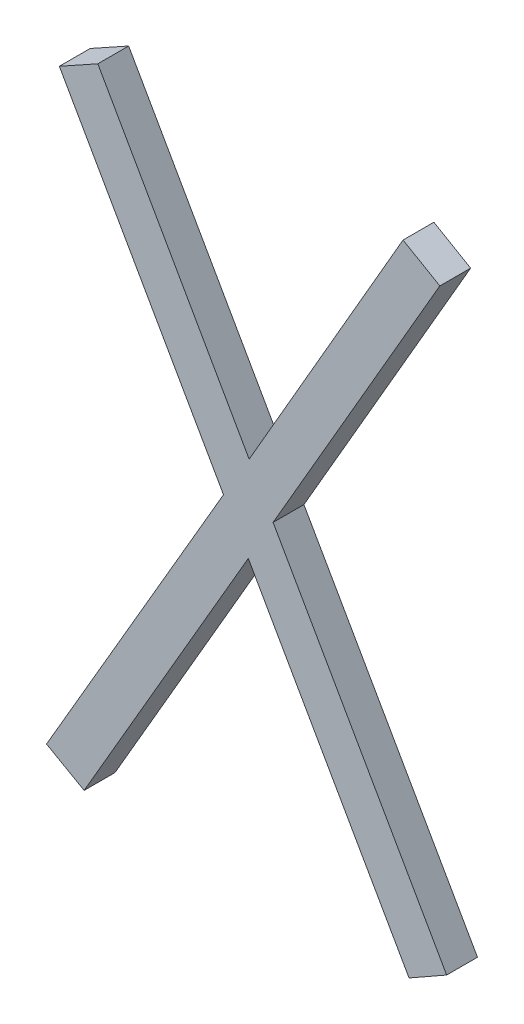
ISO-10303-21;
HEADER;
FILE_DESCRIPTION(('STEP AP214'),'2;1');
FILE_NAME('part.step','',(''),(''),'','','');
FILE_SCHEMA(('AUTOMOTIVE_DESIGN { 1 0 10303 214 1 1 1 1 }'));
ENDSEC;
DATA;
#1=APPLICATION_CONTEXT('core data for automotive mechanical design processes');
#2=APPLICATION_PROTOCOL_DEFINITION('international standard','automotive_design',2000,#1);
#3=PRODUCT_CONTEXT('',#1,'mechanical');
#4=PRODUCT('Part','Part','',(#3));
#5=PRODUCT_RELATED_PRODUCT_CATEGORY('part','',(#4));
#6=PRODUCT_DEFINITION_FORMATION('','',#4);
#7=PRODUCT_DEFINITION_CONTEXT('part definition',#1,'design');
#8=PRODUCT_DEFINITION('design','',#6,#7);
#9=PRODUCT_DEFINITION_SHAPE('','',#8);
#10=(LENGTH_UNIT() NAMED_UNIT(*) SI_UNIT(.MILLI.,.METRE.));
#11=(NAMED_UNIT(*) PLANE_ANGLE_UNIT() SI_UNIT($,.RADIAN.));
#12=(NAMED_UNIT(*) SI_UNIT($,.STERADIAN.) SOLID_ANGLE_UNIT());
#13=UNCERTAINTY_MEASURE_WITH_UNIT(LENGTH_MEASURE(1.E-05),#10,'distance_accuracy_value','');
#14=(GEOMETRIC_REPRESENTATION_CONTEXT(3) GLOBAL_UNCERTAINTY_ASSIGNED_CONTEXT((#13)) GLOBAL_UNIT_ASSIGNED_CONTEXT((#10,
#11,#12)) REPRESENTATION_CONTEXT('',''));
#15=CARTESIAN_POINT('',(0.,0.,0.));
#16=DIRECTION('',(0.,0.,1.));
#17=DIRECTION('',(1.,0.,0.));
#18=AXIS2_PLACEMENT_3D('',#15,#16,#17);
#19=CARTESIAN_POINT('',(69.1369278636028,62.3126359816895,-39.));
#20=DIRECTION('',(0.,0.,-1.));
#21=DIRECTION('',(-1.,0.,0.));
#22=AXIS2_PLACEMENT_3D('',#19,#20,#21);
#23=PLANE('',#22);
#24=DIRECTION('',(-0.501757199087616,-0.865008504677122,0.));
#25=VECTOR('',#24,1.);
#26=CARTESIAN_POINT('',(69.2544005786117,62.2458901208888,-39.));
#27=LINE('',#26,#25);
#28=CARTESIAN_POINT('',(69.2544005785957,62.245890120898,-39.));
#29=VERTEX_POINT('',#28);
#30=CARTESIAN_POINT('',(69.7869941985798,63.1640593303252,-39.));
#31=VERTEX_POINT('',#30);
#32=EDGE_CURVE('E161',#29,#31,#27,.F.);
#33=ORIENTED_EDGE('',*,*,#32,.T.);
#34=DIRECTION('',(-0.493874000371207,0.869533479376925,0.));
#35=VECTOR('',#34,1.);
#36=CARTESIAN_POINT('',(69.7869941985484,63.1640593303073,-39.));
#37=LINE('',#36,#35);
#38=CARTESIAN_POINT('',(70.3084921180918,62.2458901208985,-39.));
#39=VERTEX_POINT('',#38);
#40=EDGE_CURVE('E156',#31,#39,#37,.F.);
#41=ORIENTED_EDGE('',*,*,#40,.T.);
#42=DIRECTION('',(-0.869456557392789,-0.494009407609491,0.));
#43=VECTOR('',#42,1.);
#44=CARTESIAN_POINT('',(70.3084921180962,62.2458901208908,-39.));
#45=LINE('',#44,#43);
#46=CARTESIAN_POINT('',(70.4305448226939,62.3152382485031,-39.));
#47=VERTEX_POINT('',#46);
#48=EDGE_CURVE('E152',#39,#47,#45,.F.);
#49=ORIENTED_EDGE('',*,*,#48,.T.);
#50=DIRECTION('',(0.494302224488502,-0.869290118927921,0.));
#51=VECTOR('',#50,1.);
#52=CARTESIAN_POINT('',(70.4305448227046,62.3152382485093,-39.));
#53=LINE('',#52,#51);
#54=CARTESIAN_POINT('',(69.8674380265982,63.3055295106284,-39.));
#55=VERTEX_POINT('',#54);
#56=EDGE_CURVE('E148',#47,#55,#53,.F.);
#57=ORIENTED_EDGE('',*,*,#56,.T.);
#58=DIRECTION('',(-0.500833770570709,-0.865543490678502,0.));
#59=VECTOR('',#58,1.);
#60=CARTESIAN_POINT('',(69.8674380266044,63.305529510633,-39.));
#61=LINE('',#60,#59);
#62=CARTESIAN_POINT('',(70.4083534218833,64.2403422706789,-39.));
#63=VERTEX_POINT('',#62);
#64=EDGE_CURVE('E144',#55,#63,#61,.F.);
#65=ORIENTED_EDGE('',*,*,#64,.T.);
#66=DIRECTION('',(0.864507186684205,-0.50262045737451,0.));
#67=VECTOR('',#66,1.);
#68=CARTESIAN_POINT('',(70.4083534218832,64.240342270679,-39.));
#69=LINE('',#68,#67);
#70=CARTESIAN_POINT('',(70.2890746424062,64.3096903982819,-39.));
#71=VERTEX_POINT('',#70);
#72=EDGE_CURVE('E140',#63,#71,#69,.F.);
#73=ORIENTED_EDGE('',*,*,#72,.T.);
#74=DIRECTION('',(0.499722453489597,0.866185586048589,0.));
#75=VECTOR('',#74,1.);
#76=CARTESIAN_POINT('',(70.2890746424062,64.309690398282,-39.));
#77=LINE('',#76,#75);
#78=CARTESIAN_POINT('',(69.789768123692,63.4442257658421,-39.));
#79=VERTEX_POINT('',#78);
#80=EDGE_CURVE('E136',#71,#79,#77,.F.);
#81=ORIENTED_EDGE('',*,*,#80,.T.);
#82=DIRECTION('',(0.493434547487691,-0.869782931164792,0.));
#83=VECTOR('',#82,1.);
#84=CARTESIAN_POINT('',(69.7897681236972,63.444225765845,-39.));
#85=LINE('',#84,#83);
#86=CARTESIAN_POINT('',(69.2987833802891,64.3096903982932,-39.));
#87=VERTEX_POINT('',#86);
#88=EDGE_CURVE('E132',#79,#87,#85,.F.);
#89=ORIENTED_EDGE('',*,*,#88,.T.);
#90=DIRECTION('',(0.874157276121608,0.485642931178506,0.));
#91=VECTOR('',#90,1.);
#92=CARTESIAN_POINT('',(69.2987833802856,64.3096903982996,-39.));
#93=LINE('',#92,#91);
#94=CARTESIAN_POINT('',(69.1739567506111,64.2403422707027,-39.));
#95=VERTEX_POINT('',#94);
#96=EDGE_CURVE('E128',#87,#95,#93,.F.);
#97=ORIENTED_EDGE('',*,*,#96,.T.);
#98=DIRECTION('',(-0.493921009717616,0.869506777523632,0.));
#99=VECTOR('',#98,1.);
#100=CARTESIAN_POINT('',(69.173956750611,64.2403422707029,-39.));
#101=LINE('',#100,#99);
#102=CARTESIAN_POINT('',(69.7065503705775,63.3027555855385,-39.));
#103=VERTEX_POINT('',#102);
#104=EDGE_CURVE('E104',#95,#103,#101,.F.);
#105=ORIENTED_EDGE('',*,*,#104,.T.);
#106=DIRECTION('',(0.50266266285791,0.864482647233937,0.));
#107=VECTOR('',#106,1.);
#108=CARTESIAN_POINT('',(69.7065503705391,63.3027555855609,-39.));
#109=LINE('',#108,#107);
#110=CARTESIAN_POINT('',(69.1323478739962,62.3152382485115,-39.));
#111=VERTEX_POINT('',#110);
#112=EDGE_CURVE('E106',#103,#111,#109,.F.);
#113=ORIENTED_EDGE('',*,*,#112,.T.);
#114=DIRECTION('',(-0.86945655739271,0.49400940760963,0.));
#115=VECTOR('',#114,1.);
#116=CARTESIAN_POINT('',(69.1323478739962,62.3152382485115,-39.));
#117=LINE('',#116,#115);
#118=EDGE_CURVE('E20',#111,#29,#117,.F.);
#119=ORIENTED_EDGE('',*,*,#118,.T.);
#120=EDGE_LOOP('',(#33,#41,#49,#57,#65,#73,#81,#89,#97,#105,#113,#119));
#121=FACE_BOUND('',#120,.T.);
#122=ADVANCED_FACE('F17',(#121),#23,.F.);
#123=CARTESIAN_POINT('',(69.1323478739962,62.3152382485115,-39.));
#124=DIRECTION('',(0.49400940760963,0.86945655739271,0.));
#125=DIRECTION('',(-0.86945655739271,0.49400940760963,0.));
#126=AXIS2_PLACEMENT_3D('',#123,#124,#125);
#127=PLANE('',#126);
#128=DIRECTION('',(0.,0.,1.));
#129=VECTOR('',#128,1.);
#130=CARTESIAN_POINT('',(69.2544005786117,62.2458901208887,-39.));
#131=LINE('',#130,#129);
#132=CARTESIAN_POINT('',(69.2544005785957,62.245890120898,-39.1));
#133=VERTEX_POINT('',#132);
#134=EDGE_CURVE('E117',#133,#29,#131,.T.);
#135=ORIENTED_EDGE('',*,*,#134,.T.);
#136=ORIENTED_EDGE('',*,*,#118,.F.);
#137=DIRECTION('',(0.,0.,1.));
#138=VECTOR('',#137,1.);
#139=CARTESIAN_POINT('',(69.1323478739963,62.3152382485114,-39.));
#140=LINE('',#139,#138);
#141=CARTESIAN_POINT('',(69.1323478739962,62.3152382485115,-39.1));
#142=VERTEX_POINT('',#141);
#143=EDGE_CURVE('E112',#111,#142,#140,.F.);
#144=ORIENTED_EDGE('',*,*,#143,.T.);
#145=DIRECTION('',(-0.869456557392426,0.494009407610129,0.));
#146=VECTOR('',#145,1.);
#147=CARTESIAN_POINT('',(69.2544005785903,62.2458901209011,-39.1));
#148=LINE('',#147,#146);
#149=EDGE_CURVE('E164',#133,#142,#148,.T.);
#150=ORIENTED_EDGE('',*,*,#149,.F.);
#151=EDGE_LOOP('',(#135,#136,#144,#150));
#152=FACE_BOUND('',#151,.T.);
#153=ADVANCED_FACE('F114',(#152),#127,.F.);
#154=CARTESIAN_POINT('',(69.7065503705391,63.3027555855609,-39.));
#155=DIRECTION('',(0.864482647233937,-0.50266266285791,0.));
#156=DIRECTION('',(0.50266266285791,0.864482647233937,0.));
#157=AXIS2_PLACEMENT_3D('',#154,#155,#156);
#158=PLANE('',#157);
#159=ORIENTED_EDGE('',*,*,#143,.F.);
#160=ORIENTED_EDGE('',*,*,#112,.F.);
#161=DIRECTION('',(0.,0.,1.));
#162=VECTOR('',#161,1.);
#163=CARTESIAN_POINT('',(69.7065503705903,63.3027555855311,-39.));
#164=LINE('',#163,#162);
#165=CARTESIAN_POINT('',(69.7065503705647,63.302755585546,-39.1));
#166=VERTEX_POINT('',#165);
#167=EDGE_CURVE('E124',#103,#166,#164,.F.);
#168=ORIENTED_EDGE('',*,*,#167,.T.);
#169=DIRECTION('',(0.502662662902861,0.864482647207799,0.));
#170=VECTOR('',#169,1.);
#171=CARTESIAN_POINT('',(69.1323478739962,62.3152382485115,-39.1));
#172=LINE('',#171,#170);
#173=EDGE_CURVE('E121',#142,#166,#172,.T.);
#174=ORIENTED_EDGE('',*,*,#173,.F.);
#175=EDGE_LOOP('',(#159,#160,#168,#174));
#176=FACE_BOUND('',#175,.T.);
#177=ADVANCED_FACE('F119',(#176),#158,.F.);
#178=CARTESIAN_POINT('',(69.173956750611,64.2403422707029,-39.));
#179=DIRECTION('',(0.869506777523632,0.493921009717616,0.));
#180=DIRECTION('',(-0.493921009717616,0.869506777523632,0.));
#181=AXIS2_PLACEMENT_3D('',#178,#179,#180);
#182=PLANE('',#181);
#183=ORIENTED_EDGE('',*,*,#167,.F.);
#184=ORIENTED_EDGE('',*,*,#104,.F.);
#185=DIRECTION('',(0.,0.,1.));
#186=VECTOR('',#185,1.);
#187=CARTESIAN_POINT('',(69.1739567506111,64.2403422707027,-39.));
#188=LINE('',#187,#186);
#189=CARTESIAN_POINT('',(69.1739567506111,64.2403422707027,-39.1));
#190=VERTEX_POINT('',#189);
#191=EDGE_CURVE('E130',#95,#190,#188,.F.);
#192=ORIENTED_EDGE('',*,*,#191,.T.);
#193=DIRECTION('',(-0.493921009717636,0.86950677752362,0.));
#194=VECTOR('',#193,1.);
#195=CARTESIAN_POINT('',(69.7065503705903,63.3027555855311,-39.1));
#196=LINE('',#195,#194);
#197=EDGE_CURVE('E167',#166,#190,#196,.T.);
#198=ORIENTED_EDGE('',*,*,#197,.F.);
#199=EDGE_LOOP('',(#183,#184,#192,#198));
#200=FACE_BOUND('',#199,.T.);
#201=ADVANCED_FACE('F232',(#200),#182,.F.);
#202=CARTESIAN_POINT('',(69.2987833802856,64.3096903982996,-39.));
#203=DIRECTION('',(0.485642931178506,-0.874157276121608,0.));
#204=DIRECTION('',(0.874157276121608,0.485642931178506,0.));
#205=AXIS2_PLACEMENT_3D('',#202,#203,#204);
#206=PLANE('',#205);
#207=ORIENTED_EDGE('',*,*,#191,.F.);
#208=ORIENTED_EDGE('',*,*,#96,.F.);
#209=DIRECTION('',(0.,0.,1.));
#210=VECTOR('',#209,1.);
#211=CARTESIAN_POINT('',(69.2987833802903,64.3096903982911,-39.));
#212=LINE('',#211,#210);
#213=CARTESIAN_POINT('',(69.2987833802879,64.3096903982953,-39.1));
#214=VERTEX_POINT('',#213);
#215=EDGE_CURVE('E134',#87,#214,#212,.F.);
#216=ORIENTED_EDGE('',*,*,#215,.T.);
#217=DIRECTION('',(0.874157276154727,0.48564293111889,0.));
#218=VECTOR('',#217,1.);
#219=CARTESIAN_POINT('',(69.1739567506111,64.2403422707027,-39.1));
#220=LINE('',#219,#218);
#221=EDGE_CURVE('E170',#190,#214,#220,.T.);
#222=ORIENTED_EDGE('',*,*,#221,.F.);
#223=EDGE_LOOP('',(#207,#208,#216,#222));
#224=FACE_BOUND('',#223,.T.);
#225=ADVANCED_FACE('F230',(#224),#206,.F.);
#226=CARTESIAN_POINT('',(69.7897681236972,63.444225765845,-39.));
#227=DIRECTION('',(-0.869782931164792,-0.493434547487691,0.));
#228=DIRECTION('',(0.493434547487691,-0.869782931164792,0.));
#229=AXIS2_PLACEMENT_3D('',#226,#227,#228);
#230=PLANE('',#229);
#231=ORIENTED_EDGE('',*,*,#215,.F.);
#232=ORIENTED_EDGE('',*,*,#88,.F.);
#233=DIRECTION('',(0.,0.,1.));
#234=VECTOR('',#233,1.);
#235=CARTESIAN_POINT('',(69.7897681236903,63.4442257658411,-39.));
#236=LINE('',#235,#234);
#237=CARTESIAN_POINT('',(69.7897681236937,63.4442257658431,-39.1));
#238=VERTEX_POINT('',#237);
#239=EDGE_CURVE('E138',#79,#238,#236,.F.);
#240=ORIENTED_EDGE('',*,*,#239,.T.);
#241=DIRECTION('',(0.493434547480771,-0.869782931168718,0.));
#242=VECTOR('',#241,1.);
#243=CARTESIAN_POINT('',(69.2987833802903,64.3096903982911,-39.1));
#244=LINE('',#243,#242);
#245=EDGE_CURVE('E173',#214,#238,#244,.T.);
#246=ORIENTED_EDGE('',*,*,#245,.F.);
#247=EDGE_LOOP('',(#231,#232,#240,#246));
#248=FACE_BOUND('',#247,.T.);
#249=ADVANCED_FACE('F225',(#248),#230,.F.);
#250=CARTESIAN_POINT('',(70.2890746424062,64.309690398282,-39.));
#251=DIRECTION('',(0.866185586048589,-0.499722453489597,0.));
#252=DIRECTION('',(0.499722453489597,0.866185586048589,0.));
#253=AXIS2_PLACEMENT_3D('',#250,#251,#252);
#254=PLANE('',#253);
#255=ORIENTED_EDGE('',*,*,#239,.F.);
#256=ORIENTED_EDGE('',*,*,#80,.F.);
#257=DIRECTION('',(0.,0.,1.));
#258=VECTOR('',#257,1.);
#259=CARTESIAN_POINT('',(70.2890746424062,64.3096903982819,-39.));
#260=LINE('',#259,#258);
#261=CARTESIAN_POINT('',(70.2890746424062,64.3096903982819,-39.1));
#262=VERTEX_POINT('',#261);
#263=EDGE_CURVE('E142',#71,#262,#260,.F.);
#264=ORIENTED_EDGE('',*,*,#263,.T.);
#265=DIRECTION('',(0.499722453489612,0.866185586048581,0.));
#266=VECTOR('',#265,1.);
#267=CARTESIAN_POINT('',(69.7897681236903,63.4442257658411,-39.1));
#268=LINE('',#267,#266);
#269=EDGE_CURVE('E176',#238,#262,#268,.T.);
#270=ORIENTED_EDGE('',*,*,#269,.F.);
#271=EDGE_LOOP('',(#255,#256,#264,#270));
#272=FACE_BOUND('',#271,.T.);
#273=ADVANCED_FACE('F220',(#272),#254,.F.);
#274=CARTESIAN_POINT('',(70.4083534218832,64.240342270679,-39.));
#275=DIRECTION('',(-0.50262045737451,-0.864507186684205,0.));
#276=DIRECTION('',(0.864507186684205,-0.50262045737451,0.));
#277=AXIS2_PLACEMENT_3D('',#274,#275,#276);
#278=PLANE('',#277);
#279=ORIENTED_EDGE('',*,*,#263,.F.);
#280=ORIENTED_EDGE('',*,*,#72,.F.);
#281=DIRECTION('',(0.,0.,1.));
#282=VECTOR('',#281,1.);
#283=CARTESIAN_POINT('',(70.4083534218833,64.2403422706789,-39.));
#284=LINE('',#283,#282);
#285=CARTESIAN_POINT('',(70.4083534218833,64.2403422706789,-39.1));
#286=VERTEX_POINT('',#285);
#287=EDGE_CURVE('E146',#63,#286,#284,.F.);
#288=ORIENTED_EDGE('',*,*,#287,.T.);
#289=DIRECTION('',(0.864507186684116,-0.502620457374664,0.));
#290=VECTOR('',#289,1.);
#291=CARTESIAN_POINT('',(70.2890746424062,64.3096903982819,-39.1));
#292=LINE('',#291,#290);
#293=EDGE_CURVE('E179',#262,#286,#292,.T.);
#294=ORIENTED_EDGE('',*,*,#293,.F.);
#295=EDGE_LOOP('',(#279,#280,#288,#294));
#296=FACE_BOUND('',#295,.T.);
#297=ADVANCED_FACE('F215',(#296),#278,.F.);
#298=CARTESIAN_POINT('',(69.8674380266044,63.305529510633,-39.));
#299=DIRECTION('',(-0.865543490678502,0.500833770570709,0.));
#300=DIRECTION('',(-0.500833770570709,-0.865543490678502,0.));
#301=AXIS2_PLACEMENT_3D('',#298,#299,#300);
#302=PLANE('',#301);
#303=ORIENTED_EDGE('',*,*,#287,.F.);
#304=ORIENTED_EDGE('',*,*,#64,.F.);
#305=DIRECTION('',(0.,0.,1.));
#306=VECTOR('',#305,1.);
#307=CARTESIAN_POINT('',(69.8674380265973,63.3055295106289,-39.));
#308=LINE('',#307,#306);
#309=CARTESIAN_POINT('',(69.8674380265991,63.3055295106279,-39.1));
#310=VERTEX_POINT('',#309);
#311=EDGE_CURVE('E150',#55,#310,#308,.F.);
#312=ORIENTED_EDGE('',*,*,#311,.T.);
#313=DIRECTION('',(-0.500833770574021,-0.865543490676585,0.));
#314=VECTOR('',#313,1.);
#315=CARTESIAN_POINT('',(70.4083534218833,64.2403422706789,-39.1));
#316=LINE('',#315,#314);
#317=EDGE_CURVE('E182',#286,#310,#316,.T.);
#318=ORIENTED_EDGE('',*,*,#317,.F.);
#319=EDGE_LOOP('',(#303,#304,#312,#318));
#320=FACE_BOUND('',#319,.T.);
#321=ADVANCED_FACE('F210',(#320),#302,.F.);
#322=CARTESIAN_POINT('',(70.4305448227046,62.3152382485093,-39.));
#323=DIRECTION('',(-0.869290118927921,-0.494302224488502,0.));
#324=DIRECTION('',(0.494302224488502,-0.869290118927921,0.));
#325=AXIS2_PLACEMENT_3D('',#322,#323,#324);
#326=PLANE('',#325);
#327=ORIENTED_EDGE('',*,*,#311,.F.);
#328=ORIENTED_EDGE('',*,*,#56,.F.);
#329=DIRECTION('',(0.,0.,1.));
#330=VECTOR('',#329,1.);
#331=CARTESIAN_POINT('',(70.4305448226903,62.3152382485011,-39.));
#332=LINE('',#331,#330);
#333=CARTESIAN_POINT('',(70.4305448226975,62.3152382485052,-39.1));
#334=VERTEX_POINT('',#333);
#335=EDGE_CURVE('E154',#47,#334,#332,.F.);
#336=ORIENTED_EDGE('',*,*,#335,.T.);
#337=DIRECTION('',(0.494302224475921,-0.869290118935075,0.));
#338=VECTOR('',#337,1.);
#339=CARTESIAN_POINT('',(69.8674380265973,63.3055295106289,-39.1));
#340=LINE('',#339,#338);
#341=EDGE_CURVE('E185',#310,#334,#340,.T.);
#342=ORIENTED_EDGE('',*,*,#341,.F.);
#343=EDGE_LOOP('',(#327,#328,#336,#342));
#344=FACE_BOUND('',#343,.T.);
#345=ADVANCED_FACE('F205',(#344),#326,.F.);
#346=CARTESIAN_POINT('',(70.3084921180962,62.2458901208908,-39.));
#347=DIRECTION('',(-0.494009407609491,0.869456557392789,0.));
#348=DIRECTION('',(-0.869456557392789,-0.494009407609491,0.));
#349=AXIS2_PLACEMENT_3D('',#346,#347,#348);
#350=PLANE('',#349);
#351=ORIENTED_EDGE('',*,*,#335,.F.);
#352=ORIENTED_EDGE('',*,*,#48,.F.);
#353=DIRECTION('',(0.,0.,1.));
#354=VECTOR('',#353,1.);
#355=CARTESIAN_POINT('',(70.3084921180903,62.2458901209011,-39.));
#356=LINE('',#355,#354);
#357=CARTESIAN_POINT('',(70.3084921180932,62.2458901208959,-39.1));
#358=VERTEX_POINT('',#357);
#359=EDGE_CURVE('E158',#39,#358,#356,.F.);
#360=ORIENTED_EDGE('',*,*,#359,.T.);
#361=DIRECTION('',(-0.869456557434484,-0.494009407536107,0.));
#362=VECTOR('',#361,1.);
#363=CARTESIAN_POINT('',(70.4305448226903,62.3152382485011,-39.1));
#364=LINE('',#363,#362);
#365=EDGE_CURVE('E188',#334,#358,#364,.T.);
#366=ORIENTED_EDGE('',*,*,#365,.F.);
#367=EDGE_LOOP('',(#351,#352,#360,#366));
#368=FACE_BOUND('',#367,.T.);
#369=ADVANCED_FACE('F200',(#368),#350,.F.);
#370=CARTESIAN_POINT('',(69.7869941985484,63.1640593303073,-39.));
#371=DIRECTION('',(0.869533479376925,0.493874000371207,0.));
#372=DIRECTION('',(-0.493874000371207,0.869533479376925,0.));
#373=AXIS2_PLACEMENT_3D('',#370,#371,#372);
#374=PLANE('',#373);
#375=ORIENTED_EDGE('',*,*,#359,.F.);
#376=ORIENTED_EDGE('',*,*,#40,.F.);
#377=DIRECTION('',(0.,0.,1.));
#378=VECTOR('',#377,1.);
#379=CARTESIAN_POINT('',(69.7869941985903,63.1640593303311,-39.));
#380=LINE('',#379,#378);
#381=CARTESIAN_POINT('',(69.7869941985693,63.1640593303192,-39.1));
#382=VERTEX_POINT('',#381);
#383=EDGE_CURVE('E35',#31,#382,#380,.F.);
#384=ORIENTED_EDGE('',*,*,#383,.T.);
#385=DIRECTION('',(-0.493874000331511,0.869533479399472,0.));
#386=VECTOR('',#385,1.);
#387=CARTESIAN_POINT('',(70.3084921180903,62.2458901209011,-39.1));
#388=LINE('',#387,#386);
#389=EDGE_CURVE('E26',#358,#382,#388,.T.);
#390=ORIENTED_EDGE('',*,*,#389,.F.);
#391=EDGE_LOOP('',(#375,#376,#384,#390));
#392=FACE_BOUND('',#391,.T.);
#393=ADVANCED_FACE('F196',(#392),#374,.F.);
#394=CARTESIAN_POINT('',(69.2544005786117,62.2458901208888,-39.));
#395=DIRECTION('',(-0.865008504677122,0.501757199087616,0.));
#396=DIRECTION('',(-0.501757199087616,-0.865008504677122,0.));
#397=AXIS2_PLACEMENT_3D('',#394,#395,#396);
#398=PLANE('',#397);
#399=ORIENTED_EDGE('',*,*,#383,.F.);
#400=ORIENTED_EDGE('',*,*,#32,.F.);
#401=ORIENTED_EDGE('',*,*,#134,.F.);
#402=DIRECTION('',(-0.501757199107726,-0.865008504665457,0.));
#403=VECTOR('',#402,1.);
#404=CARTESIAN_POINT('',(69.7869941985903,63.1640593303311,-39.1));
#405=LINE('',#404,#403);
#406=EDGE_CURVE('E11',#382,#133,#405,.T.);
#407=ORIENTED_EDGE('',*,*,#406,.F.);
#408=EDGE_LOOP('',(#399,#400,#401,#407));
#409=FACE_BOUND('',#408,.T.);
#410=ADVANCED_FACE('F235',(#409),#398,.F.);
#411=CARTESIAN_POINT('',(69.1369278636028,62.3126359816895,-39.1));
#412=DIRECTION('',(0.,0.,-1.));
#413=DIRECTION('',(-1.,0.,0.));
#414=AXIS2_PLACEMENT_3D('',#411,#412,#413);
#415=PLANE('',#414);
#416=ORIENTED_EDGE('',*,*,#389,.T.);
#417=ORIENTED_EDGE('',*,*,#406,.T.);
#418=ORIENTED_EDGE('',*,*,#149,.T.);
#419=ORIENTED_EDGE('',*,*,#173,.T.);
#420=ORIENTED_EDGE('',*,*,#197,.T.);
#421=ORIENTED_EDGE('',*,*,#221,.T.);
#422=ORIENTED_EDGE('',*,*,#245,.T.);
#423=ORIENTED_EDGE('',*,*,#269,.T.);
#424=ORIENTED_EDGE('',*,*,#293,.T.);
#425=ORIENTED_EDGE('',*,*,#317,.T.);
#426=ORIENTED_EDGE('',*,*,#341,.T.);
#427=ORIENTED_EDGE('',*,*,#365,.T.);
#428=EDGE_LOOP('',(#416,#417,#418,#419,#420,#421,#422,#423,#424,#425,#426,#427));
#429=FACE_BOUND('',#428,.T.);
#430=ADVANCED_FACE('F193',(#429),#415,.T.);
#431=CLOSED_SHELL('',(#122,#153,#177,#201,#225,#249,#273,#297,#321,#345,#369,#393,#410,#430));
#432=MANIFOLD_SOLID_BREP('B1',#431);
#433=ADVANCED_BREP_SHAPE_REPRESENTATION('',(#18,#432),#14);
#434=SHAPE_DEFINITION_REPRESENTATION(#9,#433);
ENDSEC;
END-ISO-10303-21;
